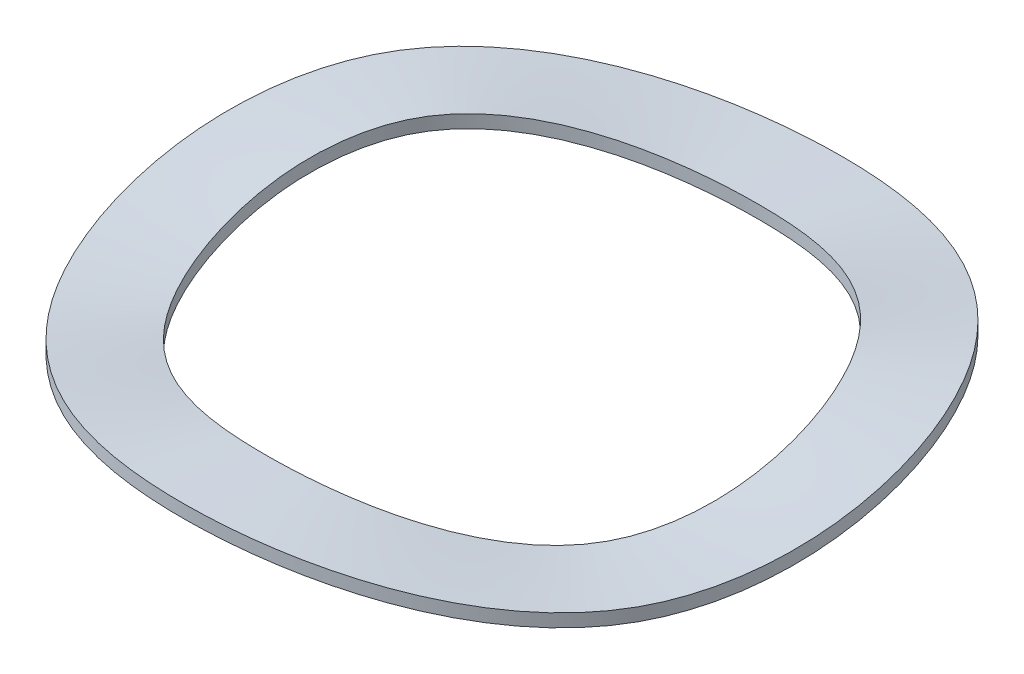
ISO-10303-21;
HEADER;
FILE_DESCRIPTION(('STEP AP214'),'2;1');
FILE_NAME('part.step','',(''),(''),'','','');
FILE_SCHEMA(('AUTOMOTIVE_DESIGN { 1 0 10303 214 1 1 1 1 }'));
ENDSEC;
DATA;
#1=APPLICATION_CONTEXT('core data for automotive mechanical design processes');
#2=APPLICATION_PROTOCOL_DEFINITION('international standard','automotive_design',2000,#1);
#3=PRODUCT_CONTEXT('',#1,'mechanical');
#4=PRODUCT('Part','Part','',(#3));
#5=PRODUCT_RELATED_PRODUCT_CATEGORY('part','',(#4));
#6=PRODUCT_DEFINITION_FORMATION('','',#4);
#7=PRODUCT_DEFINITION_CONTEXT('part definition',#1,'design');
#8=PRODUCT_DEFINITION('design','',#6,#7);
#9=PRODUCT_DEFINITION_SHAPE('','',#8);
#10=(LENGTH_UNIT() NAMED_UNIT(*) SI_UNIT(.MILLI.,.METRE.));
#11=(NAMED_UNIT(*) PLANE_ANGLE_UNIT() SI_UNIT($,.RADIAN.));
#12=(NAMED_UNIT(*) SI_UNIT($,.STERADIAN.) SOLID_ANGLE_UNIT());
#13=UNCERTAINTY_MEASURE_WITH_UNIT(LENGTH_MEASURE(1.E-05),#10,'distance_accuracy_value','');
#14=(GEOMETRIC_REPRESENTATION_CONTEXT(3) GLOBAL_UNCERTAINTY_ASSIGNED_CONTEXT((#13)) GLOBAL_UNIT_ASSIGNED_CONTEXT((#10,
#11,#12)) REPRESENTATION_CONTEXT('',''));
#15=CARTESIAN_POINT('',(0.,0.,0.));
#16=DIRECTION('',(0.,0.,1.));
#17=DIRECTION('',(1.,0.,0.));
#18=AXIS2_PLACEMENT_3D('',#15,#16,#17);
#19=CARTESIAN_POINT('',(0.,0.508000000000008,-12.9032));
#20=CARTESIAN_POINT('',(4.46979959604456,0.508000000000008,-12.9032));
#21=CARTESIAN_POINT('',(13.4093987881337,2.8956,-7.74192000000002));
#22=CARTESIAN_POINT('',(13.4093987881336,-0.685799999999986,7.74192000000007));
#23=CARTESIAN_POINT('',(0.,2.8956,15.48384));
#24=CARTESIAN_POINT('',(-13.4093987881338,-0.685799999999986,7.74191999999997));
#25=CARTESIAN_POINT('',(-13.4093987881337,1.7018,-2.58064000000007));
#26=CARTESIAN_POINT('',(-8.9395991920891,1.7018,-10.3225600000001));
#27=CARTESIAN_POINT('',(-4.46979959604455,0.508000000000008,-12.9032000000001));
#28=CARTESIAN_POINT('',(0.,0.508000000000008,-12.9032));
#29=CARTESIAN_POINT('',(0.,0.508000000000008,-11.8194666666667));
#30=CARTESIAN_POINT('',(4.0943833570067,0.508000000000008,-11.8194666666667));
#31=CARTESIAN_POINT('',(12.2831500710201,2.8956,-7.09168000000002));
#32=CARTESIAN_POINT('',(12.2831500710201,-0.685799999999986,7.09168000000007));
#33=CARTESIAN_POINT('',(0.,2.8956,14.18336));
#34=CARTESIAN_POINT('',(-12.2831500710202,-0.685800000000014,7.09167999999997));
#35=CARTESIAN_POINT('',(-12.2831500710201,1.7018,-2.3638933333334));
#36=CARTESIAN_POINT('',(-8.18876671401337,1.7018,-9.45557333333342));
#37=CARTESIAN_POINT('',(-4.09438335700669,0.508000000000008,-11.8194666666667));
#38=CARTESIAN_POINT('',(0.,0.508000000000008,-11.8194666666667));
#39=CARTESIAN_POINT('',(0.,0.508000000000008,-10.7357333333334));
#40=CARTESIAN_POINT('',(3.71896711796883,0.508000000000008,-10.7357333333334));
#41=CARTESIAN_POINT('',(11.1569013539065,2.8956,-6.44144));
#42=CARTESIAN_POINT('',(11.1569013539065,-0.685799999999986,6.44144000000006));
#43=CARTESIAN_POINT('',(0.,2.8956,12.88288));
#44=CARTESIAN_POINT('',(-11.1569013539066,-0.685800000000014,6.44143999999999));
#45=CARTESIAN_POINT('',(-11.1569013539065,1.7018,-2.14714666666673));
#46=CARTESIAN_POINT('',(-7.43793423593765,1.7018,-8.58858666666675));
#47=CARTESIAN_POINT('',(-3.71896711796883,0.508000000000008,-10.7357333333334));
#48=CARTESIAN_POINT('',(0.,0.508000000000008,-10.7357333333334));
#49=CARTESIAN_POINT('',(0.,0.508000000000008,-9.65200000000003));
#50=CARTESIAN_POINT('',(3.34355087893097,0.508000000000008,-9.65200000000002));
#51=CARTESIAN_POINT('',(10.0306526367929,2.8956,-5.79120000000001));
#52=CARTESIAN_POINT('',(10.0306526367929,-0.685800000000014,5.79120000000005));
#53=CARTESIAN_POINT('',(0.,2.8956,11.5824));
#54=CARTESIAN_POINT('',(-10.030652636793,-0.685800000000014,5.79119999999999));
#55=CARTESIAN_POINT('',(-10.0306526367929,1.7018,-1.93040000000005));
#56=CARTESIAN_POINT('',(-6.68710175786192,1.7018,-7.72160000000005));
#57=CARTESIAN_POINT('',(-3.34355087893097,0.508000000000008,-9.65200000000005));
#58=CARTESIAN_POINT('',(0.,0.508000000000008,-9.65200000000003));
#59=B_SPLINE_SURFACE_WITH_KNOTS('',3,3,((#19,#20,#21,#22,#23,#24,#25,#26,#27,#28),(#29,#30,#31,
#32,#33,#34,#35,#36,#37,#38),(#39,#40,#41,#42,#43,#44,#45,#46,#47,#48),(#49,#50,#51,#52,#53,#54,
#55,#56,#57,#58)),.UNSPECIFIED.,.F.,.T.,.F.,(4,4),(4,1,1,1,1,2,4),(0.,1.),(0.,0.166666666666667,
0.333333333333334,0.5,0.666666666666666,0.833333333333333,1.),.UNSPECIFIED.);
#60=CARTESIAN_POINT('',(0.,0.508000000000008,-9.65200000000003));
#61=CARTESIAN_POINT('',(3.34355087893097,0.508000000000008,-9.65200000000002));
#62=CARTESIAN_POINT('',(10.0306526367929,2.8956,-5.79120000000001));
#63=CARTESIAN_POINT('',(10.0306526367929,-0.685800000000014,5.79120000000005));
#64=CARTESIAN_POINT('',(0.,2.8956,11.5824));
#65=CARTESIAN_POINT('',(-10.030652636793,-0.685800000000014,5.79119999999999));
#66=CARTESIAN_POINT('',(-10.0306526367929,1.7018,-1.93040000000005));
#67=CARTESIAN_POINT('',(-6.68710175786192,1.7018,-7.72160000000005));
#68=CARTESIAN_POINT('',(-3.34355087893097,0.508000000000008,-9.65200000000005));
#69=CARTESIAN_POINT('',(0.,0.508000000000008,-9.65200000000003));
#70=B_SPLINE_CURVE_WITH_KNOTS('',3,(#60,#61,#62,#63,#64,#65,#66,#67,#68,#69),.UNSPECIFIED.,.T.,
.F.,(4,1,1,1,1,2,4),(0.,0.166666666666667,0.333333333333334,0.5,0.666666666666666,
0.833333333333333,1.),.UNSPECIFIED.);
#71=CARTESIAN_POINT('',(0.,0.508000000000008,-9.65200000000003));
#72=VERTEX_POINT('',#71);
#73=EDGE_CURVE('E20',#72,#72,#70,.F.);
#74=CARTESIAN_POINT('',(0.,0.508000000000008,-12.9032));
#75=CARTESIAN_POINT('',(4.46979959604456,0.508000000000008,-12.9032));
#76=CARTESIAN_POINT('',(13.4093987881337,2.8956,-7.74192000000002));
#77=CARTESIAN_POINT('',(13.4093987881336,-0.685799999999986,7.74192000000007));
#78=CARTESIAN_POINT('',(0.,2.8956,15.48384));
#79=CARTESIAN_POINT('',(-13.4093987881338,-0.685799999999986,7.74191999999997));
#80=CARTESIAN_POINT('',(-13.4093987881337,1.7018,-2.58064000000007));
#81=CARTESIAN_POINT('',(-8.9395991920891,1.7018,-10.3225600000001));
#82=CARTESIAN_POINT('',(-4.46979959604455,0.508000000000008,-12.9032000000001));
#83=CARTESIAN_POINT('',(0.,0.508000000000008,-12.9032));
#84=B_SPLINE_CURVE_WITH_KNOTS('',3,(#74,#75,#76,#77,#78,#79,#80,#81,#82,#83),.UNSPECIFIED.,.T.,
.F.,(4,1,1,1,1,2,4),(0.,0.166666666666667,0.333333333333334,0.5,0.666666666666666,
0.833333333333333,1.),.UNSPECIFIED.);
#85=CARTESIAN_POINT('',(0.,0.508000000000008,-12.9032));
#86=VERTEX_POINT('',#85);
#87=EDGE_CURVE('E31',#86,#86,#84,.T.);
#88=ORIENTED_EDGE('',*,*,#73,.F.);
#89=EDGE_LOOP('',(#88));
#90=FACE_BOUND('',#89,.T.);
#91=ORIENTED_EDGE('',*,*,#87,.F.);
#92=EDGE_LOOP('',(#91));
#93=FACE_BOUND('',#92,.T.);
#94=ADVANCED_FACE('F14',(#90,#93),#59,.T.);
#95=CARTESIAN_POINT('',(0.,0.508000000000008,-9.65200000000003));
#96=CARTESIAN_POINT('',(3.34355087893097,0.508000000000008,-9.65200000000002));
#97=CARTESIAN_POINT('',(10.0306526367929,2.8956,-5.79120000000001));
#98=CARTESIAN_POINT('',(10.0306526367929,-0.685800000000014,5.79120000000005));
#99=CARTESIAN_POINT('',(0.,2.8956,11.5824));
#100=CARTESIAN_POINT('',(-10.030652636793,-0.685800000000014,5.79119999999999));
#101=CARTESIAN_POINT('',(-10.0306526367929,1.7018,-1.93040000000005));
#102=CARTESIAN_POINT('',(-6.68710175786192,1.7018,-7.72160000000005));
#103=CARTESIAN_POINT('',(-3.34355087893097,0.508000000000008,-9.65200000000005));
#104=CARTESIAN_POINT('',(0.,0.508000000000008,-9.65200000000003));
#105=CARTESIAN_POINT('',(0.,0.338666666666654,-9.65200000000003));
#106=CARTESIAN_POINT('',(3.34355087893097,0.338666666666654,-9.65200000000002));
#107=CARTESIAN_POINT('',(10.0306526367929,2.72626666666667,-5.79120000000001));
#108=CARTESIAN_POINT('',(10.0306526367929,-0.855133333333341,5.79120000000005));
#109=CARTESIAN_POINT('',(0.,2.72626666666667,11.5824));
#110=CARTESIAN_POINT('',(-10.030652636793,-0.855133333333341,5.79119999999999));
#111=CARTESIAN_POINT('',(-10.0306526367929,1.53246666666668,-1.93040000000005));
#112=CARTESIAN_POINT('',(-6.68710175786192,1.53246666666668,-7.72160000000005));
#113=CARTESIAN_POINT('',(-3.34355087893097,0.338666666666654,-9.65200000000005));
#114=CARTESIAN_POINT('',(0.,0.338666666666654,-9.65200000000003));
#115=CARTESIAN_POINT('',(0.,0.169333333333327,-9.65200000000003));
#116=CARTESIAN_POINT('',(3.34355087893097,0.169333333333327,-9.65200000000002));
#117=CARTESIAN_POINT('',(10.0306526367929,2.55693333333334,-5.79120000000001));
#118=CARTESIAN_POINT('',(10.0306526367929,-1.02446666666667,5.79120000000005));
#119=CARTESIAN_POINT('',(0.,2.55693333333334,11.5824));
#120=CARTESIAN_POINT('',(-10.030652636793,-1.02446666666667,5.79119999999999));
#121=CARTESIAN_POINT('',(-10.0306526367929,1.36313333333332,-1.93040000000005));
#122=CARTESIAN_POINT('',(-6.68710175786192,1.36313333333332,-7.72160000000006));
#123=CARTESIAN_POINT('',(-3.34355087893097,0.169333333333327,-9.65200000000004));
#124=CARTESIAN_POINT('',(0.,0.169333333333327,-9.65200000000003));
#125=CARTESIAN_POINT('',(0.,0.,-9.65200000000003));
#126=CARTESIAN_POINT('',(3.34355087893097,0.,-9.65200000000002));
#127=CARTESIAN_POINT('',(10.0306526367929,2.38759999999999,-5.79120000000001));
#128=CARTESIAN_POINT('',(10.0306526367929,-1.19379999999999,5.79120000000005));
#129=CARTESIAN_POINT('',(0.,2.38759999999999,11.5824));
#130=CARTESIAN_POINT('',(-10.030652636793,-1.19379999999999,5.79119999999999));
#131=CARTESIAN_POINT('',(-10.0306526367929,1.19379999999999,-1.93040000000005));
#132=CARTESIAN_POINT('',(-6.68710175786192,1.19379999999999,-7.72160000000006));
#133=CARTESIAN_POINT('',(-3.34355087893097,0.,-9.65200000000005));
#134=CARTESIAN_POINT('',(0.,0.,-9.65200000000003));
#135=B_SPLINE_SURFACE_WITH_KNOTS('',3,3,((#95,#96,#97,#98,#99,#100,#101,#102,#103,#104),(#105,
#106,#107,#108,#109,#110,#111,#112,#113,#114),(#115,#116,#117,#118,#119,#120,#121,#122,#123,
#124),(#125,#126,#127,#128,#129,#130,#131,#132,#133,#134)),.UNSPECIFIED.,.F.,.T.,.F.,(4,4),(4,1,
1,1,1,2,4),(0.,1.),(0.,0.166666666666667,0.333333333333334,0.5,0.666666666666666,
0.833333333333333,1.),.UNSPECIFIED.);
#136=CARTESIAN_POINT('',(0.,0.,-9.65200000000003));
#137=CARTESIAN_POINT('',(3.34355087893097,0.,-9.65200000000002));
#138=CARTESIAN_POINT('',(10.0306526367929,2.38759999999999,-5.79120000000001));
#139=CARTESIAN_POINT('',(10.0306526367929,-1.19379999999999,5.79120000000005));
#140=CARTESIAN_POINT('',(0.,2.38759999999999,11.5824));
#141=CARTESIAN_POINT('',(-10.030652636793,-1.19379999999999,5.79119999999999));
#142=CARTESIAN_POINT('',(-10.0306526367929,1.19379999999999,-1.93040000000005));
#143=CARTESIAN_POINT('',(-6.68710175786192,1.19379999999999,-7.72160000000006));
#144=CARTESIAN_POINT('',(-3.34355087893097,0.,-9.65200000000005));
#145=CARTESIAN_POINT('',(0.,0.,-9.65200000000003));
#146=B_SPLINE_CURVE_WITH_KNOTS('',3,(#136,#137,#138,#139,#140,#141,#142,#143,#144,#145),
.UNSPECIFIED.,.T.,.F.,(4,1,1,1,1,2,4),(0.,0.166666666666667,0.333333333333334,0.5,
0.666666666666666,0.833333333333333,1.),.UNSPECIFIED.);
#147=CARTESIAN_POINT('',(0.,0.,-9.65200000000003));
#148=VERTEX_POINT('',#147);
#149=EDGE_CURVE('E26',#148,#148,#146,.F.);
#150=ORIENTED_EDGE('',*,*,#149,.F.);
#151=EDGE_LOOP('',(#150));
#152=FACE_BOUND('',#151,.T.);
#153=ORIENTED_EDGE('',*,*,#73,.T.);
#154=EDGE_LOOP('',(#153));
#155=FACE_BOUND('',#154,.T.);
#156=ADVANCED_FACE('F54',(#152,#155),#135,.T.);
#157=CARTESIAN_POINT('',(0.,0.,-12.9032));
#158=CARTESIAN_POINT('',(4.46979959604456,0.,-12.9032));
#159=CARTESIAN_POINT('',(13.4093987881337,2.38759999999999,-7.74192000000002));
#160=CARTESIAN_POINT('',(13.4093987881336,-1.19379999999999,7.74192000000007));
#161=CARTESIAN_POINT('',(0.,2.38759999999999,15.48384));
#162=CARTESIAN_POINT('',(-13.4093987881338,-1.19379999999999,7.74191999999998));
#163=CARTESIAN_POINT('',(-13.4093987881337,1.19379999999999,-2.58064000000007));
#164=CARTESIAN_POINT('',(-8.9395991920891,1.19379999999999,-10.3225600000001));
#165=CARTESIAN_POINT('',(-4.46979959604455,0.,-12.9032000000001));
#166=CARTESIAN_POINT('',(0.,0.,-12.9032));
#167=CARTESIAN_POINT('',(0.,0.169333333333327,-12.9032));
#168=CARTESIAN_POINT('',(4.46979959604456,0.169333333333327,-12.9032));
#169=CARTESIAN_POINT('',(13.4093987881337,2.55693333333334,-7.74192000000002));
#170=CARTESIAN_POINT('',(13.4093987881336,-1.02446666666667,7.74192000000007));
#171=CARTESIAN_POINT('',(0.,2.55693333333334,15.48384));
#172=CARTESIAN_POINT('',(-13.4093987881338,-1.02446666666667,7.74191999999998));
#173=CARTESIAN_POINT('',(-13.4093987881337,1.36313333333332,-2.58064000000007));
#174=CARTESIAN_POINT('',(-8.9395991920891,1.36313333333332,-10.3225600000001));
#175=CARTESIAN_POINT('',(-4.46979959604455,0.169333333333327,-12.9032000000001));
#176=CARTESIAN_POINT('',(0.,0.169333333333327,-12.9032));
#177=CARTESIAN_POINT('',(0.,0.338666666666654,-12.9032));
#178=CARTESIAN_POINT('',(4.46979959604456,0.338666666666654,-12.9032));
#179=CARTESIAN_POINT('',(13.4093987881337,2.72626666666667,-7.74192000000002));
#180=CARTESIAN_POINT('',(13.4093987881336,-0.855133333333341,7.74192000000007));
#181=CARTESIAN_POINT('',(0.,2.72626666666667,15.48384));
#182=CARTESIAN_POINT('',(-13.4093987881338,-0.855133333333341,7.74191999999997));
#183=CARTESIAN_POINT('',(-13.4093987881337,1.53246666666668,-2.58064000000007));
#184=CARTESIAN_POINT('',(-8.9395991920891,1.53246666666668,-10.3225600000001));
#185=CARTESIAN_POINT('',(-4.46979959604455,0.338666666666654,-12.9032000000001));
#186=CARTESIAN_POINT('',(0.,0.338666666666654,-12.9032));
#187=CARTESIAN_POINT('',(0.,0.508000000000008,-12.9032));
#188=CARTESIAN_POINT('',(4.46979959604456,0.508000000000008,-12.9032));
#189=CARTESIAN_POINT('',(13.4093987881337,2.8956,-7.74192000000002));
#190=CARTESIAN_POINT('',(13.4093987881336,-0.685799999999986,7.74192000000007));
#191=CARTESIAN_POINT('',(0.,2.8956,15.48384));
#192=CARTESIAN_POINT('',(-13.4093987881338,-0.685799999999986,7.74191999999997));
#193=CARTESIAN_POINT('',(-13.4093987881337,1.7018,-2.58064000000007));
#194=CARTESIAN_POINT('',(-8.9395991920891,1.7018,-10.3225600000001));
#195=CARTESIAN_POINT('',(-4.46979959604455,0.508000000000008,-12.9032000000001));
#196=CARTESIAN_POINT('',(0.,0.508000000000008,-12.9032));
#197=B_SPLINE_SURFACE_WITH_KNOTS('',3,3,((#157,#158,#159,#160,#161,#162,#163,#164,#165,#166),
(#167,#168,#169,#170,#171,#172,#173,#174,#175,#176),(#177,#178,#179,#180,#181,#182,#183,#184,
#185,#186),(#187,#188,#189,#190,#191,#192,#193,#194,#195,#196)),.UNSPECIFIED.,.F.,.T.,.F.,(4,4),
(4,1,1,1,1,2,4),(0.,1.),(0.,0.166666666666667,0.333333333333334,0.5,0.666666666666666,
0.833333333333333,1.),.UNSPECIFIED.);
#198=CARTESIAN_POINT('',(0.,0.,-12.9032));
#199=CARTESIAN_POINT('',(4.46979959604456,0.,-12.9032));
#200=CARTESIAN_POINT('',(13.4093987881337,2.38759999999999,-7.74192000000002));
#201=CARTESIAN_POINT('',(13.4093987881336,-1.19379999999999,7.74192000000007));
#202=CARTESIAN_POINT('',(0.,2.38759999999999,15.48384));
#203=CARTESIAN_POINT('',(-13.4093987881338,-1.19379999999999,7.74191999999998));
#204=CARTESIAN_POINT('',(-13.4093987881337,1.19379999999999,-2.58064000000007));
#205=CARTESIAN_POINT('',(-8.9395991920891,1.19379999999999,-10.3225600000001));
#206=CARTESIAN_POINT('',(-4.46979959604455,0.,-12.9032000000001));
#207=CARTESIAN_POINT('',(0.,0.,-12.9032));
#208=B_SPLINE_CURVE_WITH_KNOTS('',3,(#198,#199,#200,#201,#202,#203,#204,#205,#206,#207),
.UNSPECIFIED.,.T.,.F.,(4,1,1,1,1,2,4),(0.,0.166666666666667,0.333333333333334,0.5,
0.666666666666666,0.833333333333333,1.),.UNSPECIFIED.);
#209=CARTESIAN_POINT('',(0.,0.,-12.9032));
#210=VERTEX_POINT('',#209);
#211=EDGE_CURVE('E10',#210,#210,#208,.T.);
#212=ORIENTED_EDGE('',*,*,#87,.T.);
#213=EDGE_LOOP('',(#212));
#214=FACE_BOUND('',#213,.T.);
#215=ORIENTED_EDGE('',*,*,#211,.F.);
#216=EDGE_LOOP('',(#215));
#217=FACE_BOUND('',#216,.T.);
#218=ADVANCED_FACE('F63',(#214,#217),#197,.T.);
#219=CARTESIAN_POINT('',(0.,0.,-9.65200000000003));
#220=CARTESIAN_POINT('',(3.34355087893097,0.,-9.65200000000002));
#221=CARTESIAN_POINT('',(10.0306526367929,2.38759999999999,-5.79120000000001));
#222=CARTESIAN_POINT('',(10.0306526367929,-1.19379999999999,5.79120000000005));
#223=CARTESIAN_POINT('',(0.,2.38759999999999,11.5824));
#224=CARTESIAN_POINT('',(-10.030652636793,-1.19379999999999,5.79119999999999));
#225=CARTESIAN_POINT('',(-10.0306526367929,1.19379999999999,-1.93040000000005));
#226=CARTESIAN_POINT('',(-6.68710175786192,1.19379999999999,-7.72160000000006));
#227=CARTESIAN_POINT('',(-3.34355087893097,0.,-9.65200000000005));
#228=CARTESIAN_POINT('',(0.,0.,-9.65200000000003));
#229=CARTESIAN_POINT('',(0.,0.,-10.7357333333334));
#230=CARTESIAN_POINT('',(3.71896711796883,0.,-10.7357333333334));
#231=CARTESIAN_POINT('',(11.1569013539065,2.38759999999999,-6.44144000000001));
#232=CARTESIAN_POINT('',(11.1569013539065,-1.19379999999999,6.44144000000006));
#233=CARTESIAN_POINT('',(0.,2.38759999999999,12.88288));
#234=CARTESIAN_POINT('',(-11.1569013539066,-1.19379999999999,6.44143999999999));
#235=CARTESIAN_POINT('',(-11.1569013539065,1.19379999999999,-2.14714666666672));
#236=CARTESIAN_POINT('',(-7.43793423593764,1.19379999999999,-8.58858666666675));
#237=CARTESIAN_POINT('',(-3.71896711796883,0.,-10.7357333333334));
#238=CARTESIAN_POINT('',(0.,0.,-10.7357333333334));
#239=CARTESIAN_POINT('',(0.,0.,-11.8194666666667));
#240=CARTESIAN_POINT('',(4.0943833570067,0.,-11.8194666666667));
#241=CARTESIAN_POINT('',(12.2831500710201,2.38759999999999,-7.09168000000002));
#242=CARTESIAN_POINT('',(12.2831500710201,-1.19379999999999,7.09168000000007));
#243=CARTESIAN_POINT('',(0.,2.38759999999999,14.18336));
#244=CARTESIAN_POINT('',(-12.2831500710202,-1.19379999999999,7.09167999999998));
#245=CARTESIAN_POINT('',(-12.2831500710201,1.19379999999999,-2.3638933333334));
#246=CARTESIAN_POINT('',(-8.18876671401337,1.19379999999999,-9.45557333333342));
#247=CARTESIAN_POINT('',(-4.09438335700669,0.,-11.8194666666667));
#248=CARTESIAN_POINT('',(0.,0.,-11.8194666666667));
#249=CARTESIAN_POINT('',(0.,0.,-12.9032));
#250=CARTESIAN_POINT('',(4.46979959604456,0.,-12.9032));
#251=CARTESIAN_POINT('',(13.4093987881337,2.38759999999999,-7.74192000000002));
#252=CARTESIAN_POINT('',(13.4093987881336,-1.19379999999999,7.74192000000007));
#253=CARTESIAN_POINT('',(0.,2.38759999999999,15.48384));
#254=CARTESIAN_POINT('',(-13.4093987881338,-1.19379999999999,7.74191999999998));
#255=CARTESIAN_POINT('',(-13.4093987881337,1.19379999999999,-2.58064000000007));
#256=CARTESIAN_POINT('',(-8.9395991920891,1.19379999999999,-10.3225600000001));
#257=CARTESIAN_POINT('',(-4.46979959604455,0.,-12.9032000000001));
#258=CARTESIAN_POINT('',(0.,0.,-12.9032));
#259=B_SPLINE_SURFACE_WITH_KNOTS('',3,3,((#219,#220,#221,#222,#223,#224,#225,#226,#227,#228),
(#229,#230,#231,#232,#233,#234,#235,#236,#237,#238),(#239,#240,#241,#242,#243,#244,#245,#246,
#247,#248),(#249,#250,#251,#252,#253,#254,#255,#256,#257,#258)),.UNSPECIFIED.,.F.,.T.,.F.,(4,4),
(4,1,1,1,1,2,4),(0.,1.),(0.,0.166666666666667,0.333333333333334,0.5,0.666666666666666,
0.833333333333333,1.),.UNSPECIFIED.);
#260=ORIENTED_EDGE('',*,*,#211,.T.);
#261=EDGE_LOOP('',(#260));
#262=FACE_BOUND('',#261,.T.);
#263=ORIENTED_EDGE('',*,*,#149,.T.);
#264=EDGE_LOOP('',(#263));
#265=FACE_BOUND('',#264,.T.);
#266=ADVANCED_FACE('F16',(#262,#265),#259,.T.);
#267=CLOSED_SHELL('',(#94,#156,#218,#266));
#268=MANIFOLD_SOLID_BREP('B1',#267);
#269=ADVANCED_BREP_SHAPE_REPRESENTATION('',(#18,#268),#14);
#270=SHAPE_DEFINITION_REPRESENTATION(#9,#269);
ENDSEC;
END-ISO-10303-21;
